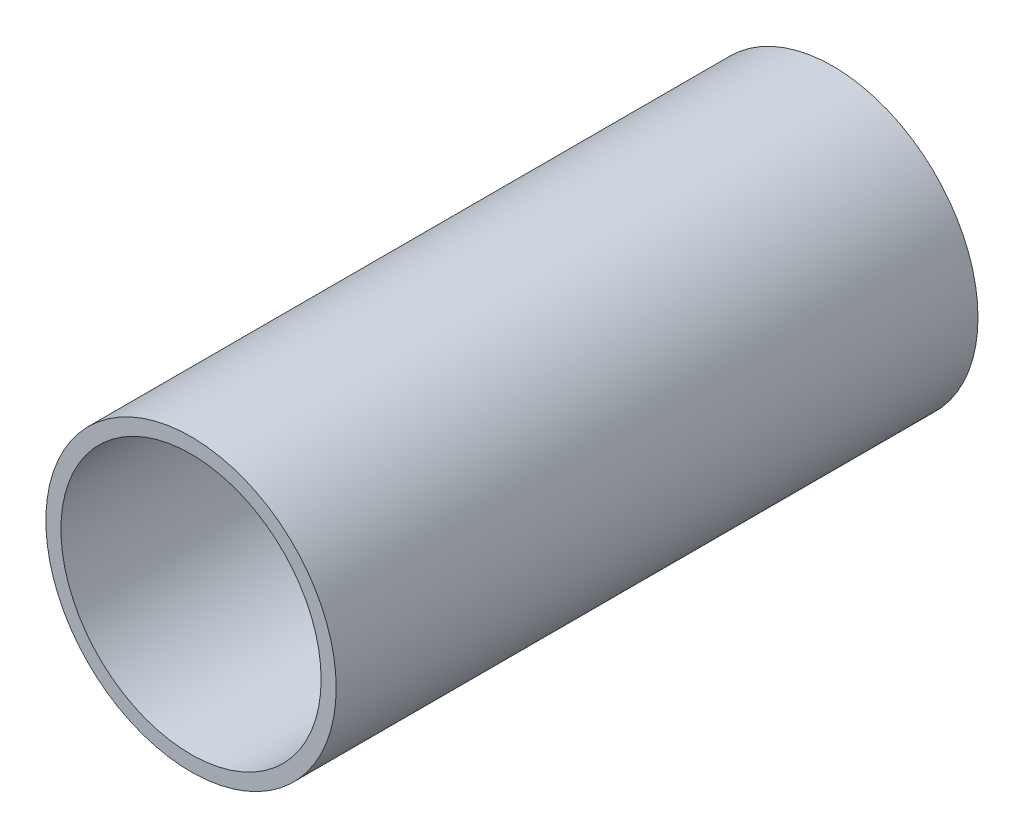
ISO-10303-21;
HEADER;
FILE_DESCRIPTION(('STEP AP214'),'2;1');
FILE_NAME('part.step','',(''),(''),'','','');
FILE_SCHEMA(('AUTOMOTIVE_DESIGN { 1 0 10303 214 1 1 1 1 }'));
ENDSEC;
DATA;
#1=APPLICATION_CONTEXT('core data for automotive mechanical design processes');
#2=APPLICATION_PROTOCOL_DEFINITION('international standard','automotive_design',2000,#1);
#3=PRODUCT_CONTEXT('',#1,'mechanical');
#4=PRODUCT('Part','Part','',(#3));
#5=PRODUCT_RELATED_PRODUCT_CATEGORY('part','',(#4));
#6=PRODUCT_DEFINITION_FORMATION('','',#4);
#7=PRODUCT_DEFINITION_CONTEXT('part definition',#1,'design');
#8=PRODUCT_DEFINITION('design','',#6,#7);
#9=PRODUCT_DEFINITION_SHAPE('','',#8);
#10=(LENGTH_UNIT() NAMED_UNIT(*) SI_UNIT(.MILLI.,.METRE.));
#11=(NAMED_UNIT(*) PLANE_ANGLE_UNIT() SI_UNIT($,.RADIAN.));
#12=(NAMED_UNIT(*) SI_UNIT($,.STERADIAN.) SOLID_ANGLE_UNIT());
#13=UNCERTAINTY_MEASURE_WITH_UNIT(LENGTH_MEASURE(1.E-05),#10,'distance_accuracy_value','');
#14=(GEOMETRIC_REPRESENTATION_CONTEXT(3) GLOBAL_UNCERTAINTY_ASSIGNED_CONTEXT((#13)) GLOBAL_UNIT_ASSIGNED_CONTEXT((#10,
#11,#12)) REPRESENTATION_CONTEXT('',''));
#15=CARTESIAN_POINT('',(0.,0.,0.));
#16=DIRECTION('',(0.,0.,1.));
#17=DIRECTION('',(1.,0.,0.));
#18=AXIS2_PLACEMENT_3D('',#15,#16,#17);
#19=CARTESIAN_POINT('',(0.,0.,-6.01200000000001));
#20=DIRECTION('',(0.,0.,1.));
#21=DIRECTION('',(1.,0.,0.));
#22=AXIS2_PLACEMENT_3D('',#19,#20,#21);
#23=CYLINDRICAL_SURFACE('',#22,4.325);
#24=CARTESIAN_POINT('',(0.,0.,21.336));
#25=DIRECTION('',(0.,0.,1.));
#26=DIRECTION('',(1.,0.,0.));
#27=AXIS2_PLACEMENT_3D('',#24,#25,#26);
#28=CIRCLE('',#27,4.325);
#29=CARTESIAN_POINT('',(4.325,0.,21.336));
#30=VERTEX_POINT('',#29);
#31=EDGE_CURVE('E57',#30,#30,#28,.T.);
#32=ORIENTED_EDGE('',*,*,#31,.T.);
#33=EDGE_LOOP('',(#32));
#34=FACE_BOUND('',#33,.T.);
#35=CARTESIAN_POINT('',(0.,0.,8.509));
#36=DIRECTION('',(0.,0.,-1.));
#37=DIRECTION('',(-1.,0.,0.));
#38=AXIS2_PLACEMENT_3D('',#35,#36,#37);
#39=CIRCLE('',#38,4.325);
#40=CARTESIAN_POINT('',(-4.325,0.,8.509));
#41=VERTEX_POINT('',#40);
#42=EDGE_CURVE('E10',#41,#41,#39,.F.);
#43=ORIENTED_EDGE('',*,*,#42,.F.);
#44=EDGE_LOOP('',(#43));
#45=FACE_BOUND('',#44,.T.);
#46=ADVANCED_FACE('F37',(#34,#45),#23,.F.);
#47=CARTESIAN_POINT('',(0.,0.,30.988));
#48=DIRECTION('',(0.,0.,-1.));
#49=DIRECTION('',(-1.,0.,0.));
#50=AXIS2_PLACEMENT_3D('',#47,#48,#49);
#51=CYLINDRICAL_SURFACE('',#50,4.826);
#52=CARTESIAN_POINT('',(0.,0.,0.));
#53=DIRECTION('',(0.,0.,1.));
#54=DIRECTION('',(1.,0.,0.));
#55=AXIS2_PLACEMENT_3D('',#52,#53,#54);
#56=CIRCLE('',#55,4.826);
#57=CARTESIAN_POINT('',(4.826,0.,0.));
#58=VERTEX_POINT('',#57);
#59=EDGE_CURVE('E44',#58,#58,#56,.T.);
#60=ORIENTED_EDGE('',*,*,#59,.T.);
#61=EDGE_LOOP('',(#60));
#62=FACE_BOUND('',#61,.T.);
#63=CARTESIAN_POINT('',(0.,0.,21.336));
#64=DIRECTION('',(0.,0.,1.));
#65=DIRECTION('',(1.,0.,0.));
#66=AXIS2_PLACEMENT_3D('',#63,#64,#65);
#67=CIRCLE('',#66,4.826);
#68=CARTESIAN_POINT('',(4.826,0.,21.336));
#69=VERTEX_POINT('',#68);
#70=EDGE_CURVE('E53',#69,#69,#67,.T.);
#71=ORIENTED_EDGE('',*,*,#70,.F.);
#72=EDGE_LOOP('',(#71));
#73=FACE_BOUND('',#72,.T.);
#74=ADVANCED_FACE('F39',(#62,#73),#51,.T.);
#75=CARTESIAN_POINT('',(0.,0.,7.874));
#76=DIRECTION('',(0.,0.,-1.));
#77=DIRECTION('',(-1.,0.,0.));
#78=AXIS2_PLACEMENT_3D('',#75,#76,#77);
#79=CIRCLE('',#78,4.325);
#80=CARTESIAN_POINT('',(-4.325,0.,7.874));
#81=VERTEX_POINT('',#80);
#82=EDGE_CURVE('E60',#81,#81,#79,.T.);
#83=ORIENTED_EDGE('',*,*,#82,.F.);
#84=EDGE_LOOP('',(#83));
#85=FACE_BOUND('',#84,.T.);
#86=CARTESIAN_POINT('',(0.,0.,0.));
#87=DIRECTION('',(0.,0.,1.));
#88=DIRECTION('',(1.,0.,0.));
#89=AXIS2_PLACEMENT_3D('',#86,#87,#88);
#90=CIRCLE('',#89,4.325);
#91=CARTESIAN_POINT('',(4.325,0.,0.));
#92=VERTEX_POINT('',#91);
#93=EDGE_CURVE('E48',#92,#92,#90,.T.);
#94=ORIENTED_EDGE('',*,*,#93,.F.);
#95=EDGE_LOOP('',(#94));
#96=FACE_BOUND('',#95,.T.);
#97=ADVANCED_FACE('F84',(#85,#96),#23,.F.);
#98=CARTESIAN_POINT('',(0.,0.,0.));
#99=DIRECTION('',(0.,0.,1.));
#100=DIRECTION('',(1.,0.,0.));
#101=AXIS2_PLACEMENT_3D('',#98,#99,#100);
#102=PLANE('',#101);
#103=ORIENTED_EDGE('',*,*,#93,.T.);
#104=EDGE_LOOP('',(#103));
#105=FACE_BOUND('',#104,.T.);
#106=ORIENTED_EDGE('',*,*,#59,.F.);
#107=EDGE_LOOP('',(#106));
#108=FACE_BOUND('',#107,.T.);
#109=ADVANCED_FACE('F87',(#105,#108),#102,.F.);
#110=CARTESIAN_POINT('',(0.,0.,21.336));
#111=DIRECTION('',(0.,0.,1.));
#112=DIRECTION('',(1.,0.,0.));
#113=AXIS2_PLACEMENT_3D('',#110,#111,#112);
#114=PLANE('',#113);
#115=ORIENTED_EDGE('',*,*,#31,.F.);
#116=EDGE_LOOP('',(#115));
#117=FACE_BOUND('',#116,.T.);
#118=ORIENTED_EDGE('',*,*,#70,.T.);
#119=EDGE_LOOP('',(#118));
#120=FACE_BOUND('',#119,.T.);
#121=ADVANCED_FACE('F93',(#117,#120),#114,.T.);
#122=CARTESIAN_POINT('',(0.,0.,8.509));
#123=DIRECTION('',(0.,0.,-1.));
#124=DIRECTION('',(-1.,0.,0.));
#125=AXIS2_PLACEMENT_3D('',#122,#123,#124);
#126=PLANE('',#125);
#127=CARTESIAN_POINT('',(0.,0.,8.509));
#128=DIRECTION('',(0.,0.,-1.));
#129=DIRECTION('',(-1.,0.,0.));
#130=AXIS2_PLACEMENT_3D('',#127,#128,#129);
#131=CIRCLE('',#130,3.81);
#132=CARTESIAN_POINT('',(-3.81,0.,8.509));
#133=VERTEX_POINT('',#132);
#134=EDGE_CURVE('E63',#133,#133,#131,.T.);
#135=ORIENTED_EDGE('',*,*,#134,.T.);
#136=EDGE_LOOP('',(#135));
#137=FACE_BOUND('',#136,.T.);
#138=ORIENTED_EDGE('',*,*,#42,.T.);
#139=EDGE_LOOP('',(#138));
#140=FACE_BOUND('',#139,.T.);
#141=ADVANCED_FACE('F70',(#137,#140),#126,.F.);
#142=CARTESIAN_POINT('',(0.,0.,7.874));
#143=DIRECTION('',(0.,0.,-1.));
#144=DIRECTION('',(-1.,0.,0.));
#145=AXIS2_PLACEMENT_3D('',#142,#143,#144);
#146=PLANE('',#145);
#147=CARTESIAN_POINT('',(0.,0.,7.874));
#148=DIRECTION('',(0.,0.,-1.));
#149=DIRECTION('',(-1.,0.,0.));
#150=AXIS2_PLACEMENT_3D('',#147,#148,#149);
#151=CIRCLE('',#150,3.81);
#152=CARTESIAN_POINT('',(-3.81,0.,7.874));
#153=VERTEX_POINT('',#152);
#154=EDGE_CURVE('E64',#153,#153,#151,.T.);
#155=ORIENTED_EDGE('',*,*,#154,.F.);
#156=EDGE_LOOP('',(#155));
#157=FACE_BOUND('',#156,.T.);
#158=ORIENTED_EDGE('',*,*,#82,.T.);
#159=EDGE_LOOP('',(#158));
#160=FACE_BOUND('',#159,.T.);
#161=ADVANCED_FACE('F75',(#157,#160),#146,.T.);
#162=CARTESIAN_POINT('',(0.,0.,8.509));
#163=DIRECTION('',(0.,0.,-1.));
#164=DIRECTION('',(-1.,0.,0.));
#165=AXIS2_PLACEMENT_3D('',#162,#163,#164);
#166=CYLINDRICAL_SURFACE('',#165,3.81);
#167=ORIENTED_EDGE('',*,*,#134,.F.);
#168=EDGE_LOOP('',(#167));
#169=FACE_BOUND('',#168,.T.);
#170=ORIENTED_EDGE('',*,*,#154,.T.);
#171=EDGE_LOOP('',(#170));
#172=FACE_BOUND('',#171,.T.);
#173=ADVANCED_FACE('F72',(#169,#172),#166,.F.);
#174=CLOSED_SHELL('',(#46,#74,#97,#109,#121,#141,#161,#173));
#175=MANIFOLD_SOLID_BREP('B2',#174);
#176=ADVANCED_BREP_SHAPE_REPRESENTATION('',(#18,#175),#14);
#177=SHAPE_DEFINITION_REPRESENTATION(#9,#176);
ENDSEC;
END-ISO-10303-21;
